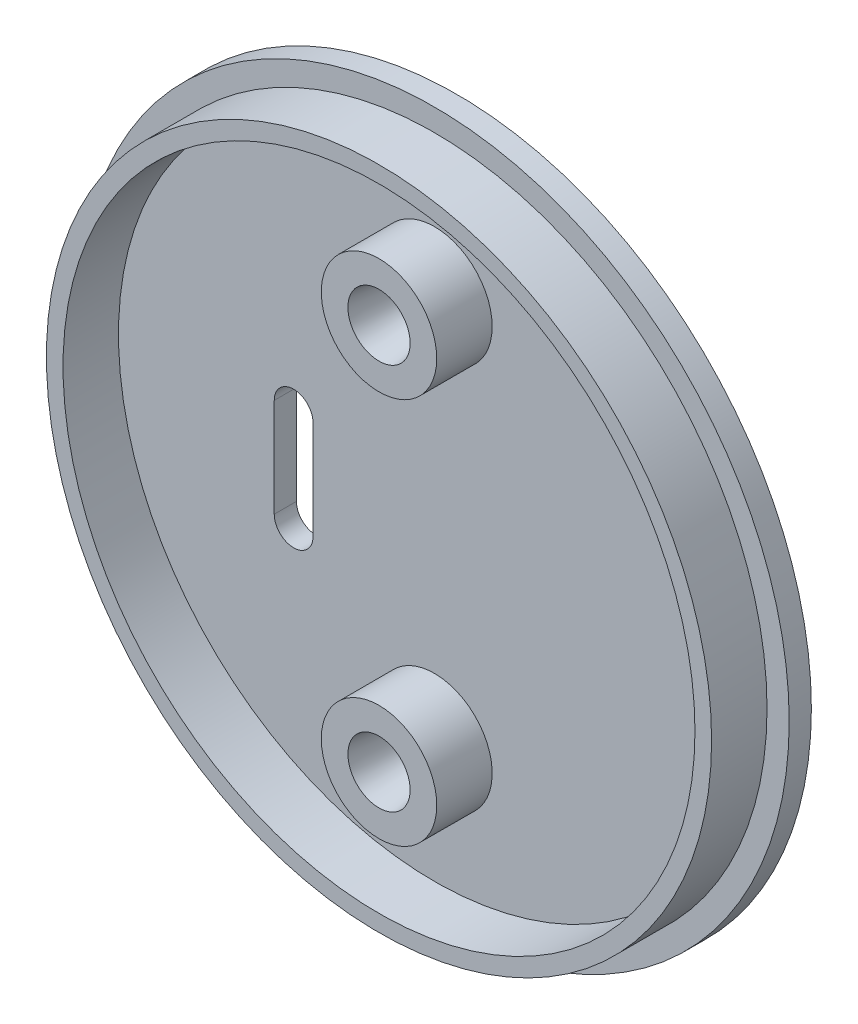
ISO-10303-21;
HEADER;
FILE_DESCRIPTION(('STEP AP214'),'2;1');
FILE_NAME('part.step','',(''),(''),'','','');
FILE_SCHEMA(('AUTOMOTIVE_DESIGN { 1 0 10303 214 1 1 1 1 }'));
ENDSEC;
DATA;
#1=APPLICATION_CONTEXT('core data for automotive mechanical design processes');
#2=APPLICATION_PROTOCOL_DEFINITION('international standard','automotive_design',2000,#1);
#3=PRODUCT_CONTEXT('',#1,'mechanical');
#4=PRODUCT('Part','Part','',(#3));
#5=PRODUCT_RELATED_PRODUCT_CATEGORY('part','',(#4));
#6=PRODUCT_DEFINITION_FORMATION('','',#4);
#7=PRODUCT_DEFINITION_CONTEXT('part definition',#1,'design');
#8=PRODUCT_DEFINITION('design','',#6,#7);
#9=PRODUCT_DEFINITION_SHAPE('','',#8);
#10=(LENGTH_UNIT() NAMED_UNIT(*) SI_UNIT(.MILLI.,.METRE.));
#11=(NAMED_UNIT(*) PLANE_ANGLE_UNIT() SI_UNIT($,.RADIAN.));
#12=(NAMED_UNIT(*) SI_UNIT($,.STERADIAN.) SOLID_ANGLE_UNIT());
#13=UNCERTAINTY_MEASURE_WITH_UNIT(LENGTH_MEASURE(1.E-05),#10,'distance_accuracy_value','');
#14=(GEOMETRIC_REPRESENTATION_CONTEXT(3) GLOBAL_UNCERTAINTY_ASSIGNED_CONTEXT((#13)) GLOBAL_UNIT_ASSIGNED_CONTEXT((#10,
#11,#12)) REPRESENTATION_CONTEXT('',''));
#15=CARTESIAN_POINT('',(0.,0.,0.));
#16=DIRECTION('',(0.,0.,1.));
#17=DIRECTION('',(1.,0.,0.));
#18=AXIS2_PLACEMENT_3D('',#15,#16,#17);
#19=CARTESIAN_POINT('',(0.,0.,0.999998));
#20=DIRECTION('',(0.,0.,-1.));
#21=DIRECTION('',(-1.,0.,0.));
#22=AXIS2_PLACEMENT_3D('',#19,#20,#21);
#23=CYLINDRICAL_SURFACE('',#22,32.);
#24=CARTESIAN_POINT('',(0.,0.,0.999998));
#25=DIRECTION('',(0.,0.,1.));
#26=DIRECTION('',(1.,0.,0.));
#27=AXIS2_PLACEMENT_3D('',#24,#25,#26);
#28=CIRCLE('',#27,32.);
#29=CARTESIAN_POINT('',(32.,0.,0.999998));
#30=VERTEX_POINT('',#29);
#31=EDGE_CURVE('E133',#30,#30,#28,.T.);
#32=ORIENTED_EDGE('',*,*,#31,.F.);
#33=EDGE_LOOP('',(#32));
#34=FACE_BOUND('',#33,.T.);
#35=CARTESIAN_POINT('',(0.,0.,-0.999998));
#36=DIRECTION('',(0.,0.,1.));
#37=DIRECTION('',(1.,0.,0.));
#38=AXIS2_PLACEMENT_3D('',#35,#36,#37);
#39=CIRCLE('',#38,32.);
#40=CARTESIAN_POINT('',(32.,0.,-0.999998));
#41=VERTEX_POINT('',#40);
#42=EDGE_CURVE('E130',#41,#41,#39,.T.);
#43=ORIENTED_EDGE('',*,*,#42,.T.);
#44=EDGE_LOOP('',(#43));
#45=FACE_BOUND('',#44,.T.);
#46=ADVANCED_FACE('F36',(#34,#45),#23,.T.);
#47=CARTESIAN_POINT('',(0.,0.,0.999998));
#48=DIRECTION('',(0.,0.,1.));
#49=DIRECTION('',(1.,0.,0.));
#50=AXIS2_PLACEMENT_3D('',#47,#48,#49);
#51=PLANE('',#50);
#52=CARTESIAN_POINT('',(0.,0.,0.999998));
#53=DIRECTION('',(0.,0.,1.));
#54=DIRECTION('',(1.,0.,0.));
#55=AXIS2_PLACEMENT_3D('',#52,#53,#54);
#56=CIRCLE('',#55,30.);
#57=CARTESIAN_POINT('',(30.,0.,0.999998));
#58=VERTEX_POINT('',#57);
#59=EDGE_CURVE('E126',#58,#58,#56,.T.);
#60=ORIENTED_EDGE('',*,*,#59,.F.);
#61=EDGE_LOOP('',(#60));
#62=FACE_BOUND('',#61,.T.);
#63=ORIENTED_EDGE('',*,*,#31,.T.);
#64=EDGE_LOOP('',(#63));
#65=FACE_BOUND('',#64,.T.);
#66=ADVANCED_FACE('F146',(#62,#65),#51,.T.);
#67=CARTESIAN_POINT('',(0.,0.,-0.999998));
#68=DIRECTION('',(0.,0.,1.));
#69=DIRECTION('',(1.,0.,0.));
#70=AXIS2_PLACEMENT_3D('',#67,#68,#69);
#71=PLANE('',#70);
#72=DIRECTION('',(0.,1.,0.));
#73=VECTOR('',#72,1.);
#74=CARTESIAN_POINT('',(-10.95,1.85420000000004,-0.999998));
#75=LINE('',#74,#73);
#76=CARTESIAN_POINT('',(-10.95,1.85420000000004,-0.999998));
#77=VERTEX_POINT('',#76);
#78=CARTESIAN_POINT('',(-10.95,-7.03579999999996,-0.999998));
#79=VERTEX_POINT('',#78);
#80=EDGE_CURVE('E102',#77,#79,#75,.F.);
#81=ORIENTED_EDGE('',*,*,#80,.F.);
#82=CARTESIAN_POINT('',(-12.7,1.85420000000004,-0.999998));
#83=DIRECTION('',(0.,0.,-1.));
#84=DIRECTION('',(-1.,0.,0.));
#85=AXIS2_PLACEMENT_3D('',#82,#83,#84);
#86=CIRCLE('',#85,1.75);
#87=CARTESIAN_POINT('',(-14.45,1.85420000000004,-0.999998));
#88=VERTEX_POINT('',#87);
#89=EDGE_CURVE('E39',#88,#77,#86,.T.);
#90=ORIENTED_EDGE('',*,*,#89,.F.);
#91=DIRECTION('',(0.,1.,0.));
#92=VECTOR('',#91,1.);
#93=CARTESIAN_POINT('',(-14.45,1.85420000000004,-0.999998));
#94=LINE('',#93,#92);
#95=CARTESIAN_POINT('',(-14.45,-7.03579999999996,-0.999998));
#96=VERTEX_POINT('',#95);
#97=EDGE_CURVE('E105',#96,#88,#94,.T.);
#98=ORIENTED_EDGE('',*,*,#97,.F.);
#99=CARTESIAN_POINT('',(-12.7,-7.03579999999996,-0.999998));
#100=DIRECTION('',(0.,0.,-1.));
#101=DIRECTION('',(-1.,0.,0.));
#102=AXIS2_PLACEMENT_3D('',#99,#100,#101);
#103=CIRCLE('',#102,1.75);
#104=EDGE_CURVE('E74',#79,#96,#103,.T.);
#105=ORIENTED_EDGE('',*,*,#104,.F.);
#106=EDGE_LOOP('',(#81,#90,#98,#105));
#107=FACE_BOUND('',#106,.T.);
#108=ORIENTED_EDGE('',*,*,#42,.F.);
#109=EDGE_LOOP('',(#108));
#110=FACE_BOUND('',#109,.T.);
#111=ADVANCED_FACE('F159',(#107,#110),#71,.F.);
#112=CARTESIAN_POINT('',(0.,0.,5.999998));
#113=DIRECTION('',(0.,0.,1.));
#114=DIRECTION('',(1.,0.,0.));
#115=AXIS2_PLACEMENT_3D('',#112,#113,#114);
#116=PLANE('',#115);
#117=CARTESIAN_POINT('',(0.,0.,5.999998));
#118=DIRECTION('',(0.,0.,1.));
#119=DIRECTION('',(1.,0.,0.));
#120=AXIS2_PLACEMENT_3D('',#117,#118,#119);
#121=CIRCLE('',#120,30.);
#122=CARTESIAN_POINT('',(30.,0.,5.999998));
#123=VERTEX_POINT('',#122);
#124=EDGE_CURVE('E127',#123,#123,#121,.T.);
#125=ORIENTED_EDGE('',*,*,#124,.T.);
#126=EDGE_LOOP('',(#125));
#127=FACE_BOUND('',#126,.T.);
#128=CARTESIAN_POINT('',(0.,0.,5.999998));
#129=DIRECTION('',(0.,0.,1.));
#130=DIRECTION('',(1.,0.,0.));
#131=AXIS2_PLACEMENT_3D('',#128,#129,#130);
#132=CIRCLE('',#131,28.5);
#133=CARTESIAN_POINT('',(28.5,0.,5.999998));
#134=VERTEX_POINT('',#133);
#135=EDGE_CURVE('E123',#134,#134,#132,.T.);
#136=ORIENTED_EDGE('',*,*,#135,.F.);
#137=EDGE_LOOP('',(#136));
#138=FACE_BOUND('',#137,.T.);
#139=ADVANCED_FACE('F170',(#127,#138),#116,.T.);
#140=CARTESIAN_POINT('',(0.,0.,5.999998));
#141=DIRECTION('',(0.,0.,-1.));
#142=DIRECTION('',(-1.,0.,0.));
#143=AXIS2_PLACEMENT_3D('',#140,#141,#142);
#144=CYLINDRICAL_SURFACE('',#143,30.);
#145=ORIENTED_EDGE('',*,*,#124,.F.);
#146=EDGE_LOOP('',(#145));
#147=FACE_BOUND('',#146,.T.);
#148=ORIENTED_EDGE('',*,*,#59,.T.);
#149=EDGE_LOOP('',(#148));
#150=FACE_BOUND('',#149,.T.);
#151=ADVANCED_FACE('F154',(#147,#150),#144,.T.);
#152=CARTESIAN_POINT('',(0.,0.,5.999998));
#153=DIRECTION('',(0.,0.,-1.));
#154=DIRECTION('',(-1.,0.,0.));
#155=AXIS2_PLACEMENT_3D('',#152,#153,#154);
#156=CYLINDRICAL_SURFACE('',#155,28.5);
#157=ORIENTED_EDGE('',*,*,#135,.T.);
#158=EDGE_LOOP('',(#157));
#159=FACE_BOUND('',#158,.T.);
#160=CARTESIAN_POINT('',(0.,0.,0.999998));
#161=DIRECTION('',(0.,0.,1.));
#162=DIRECTION('',(1.,0.,0.));
#163=AXIS2_PLACEMENT_3D('',#160,#161,#162);
#164=CIRCLE('',#163,28.5);
#165=CARTESIAN_POINT('',(28.5,0.,0.999998));
#166=VERTEX_POINT('',#165);
#167=EDGE_CURVE('E88',#166,#166,#164,.F.);
#168=ORIENTED_EDGE('',*,*,#167,.T.);
#169=EDGE_LOOP('',(#168));
#170=FACE_BOUND('',#169,.T.);
#171=ADVANCED_FACE('F141',(#159,#170),#156,.F.);
#172=CARTESIAN_POINT('',(-12.7,1.85420000000004,0.999998));
#173=DIRECTION('',(0.,0.,1.));
#174=DIRECTION('',(1.,0.,0.));
#175=AXIS2_PLACEMENT_3D('',#172,#173,#174);
#176=CIRCLE('',#175,1.75);
#177=CARTESIAN_POINT('',(-10.95,1.85420000000004,0.999998));
#178=VERTEX_POINT('',#177);
#179=CARTESIAN_POINT('',(-14.45,1.85420000000004,0.999998));
#180=VERTEX_POINT('',#179);
#181=EDGE_CURVE('E11',#178,#180,#176,.T.);
#182=ORIENTED_EDGE('',*,*,#181,.F.);
#183=DIRECTION('',(0.,1.,0.));
#184=VECTOR('',#183,1.);
#185=CARTESIAN_POINT('',(-10.95,0.,0.999998));
#186=LINE('',#185,#184);
#187=CARTESIAN_POINT('',(-10.95,-7.03579999999996,0.999998));
#188=VERTEX_POINT('',#187);
#189=EDGE_CURVE('E82',#188,#178,#186,.T.);
#190=ORIENTED_EDGE('',*,*,#189,.F.);
#191=CARTESIAN_POINT('',(-12.7,-7.03579999999996,0.999998));
#192=DIRECTION('',(0.,0.,1.));
#193=DIRECTION('',(1.,0.,0.));
#194=AXIS2_PLACEMENT_3D('',#191,#192,#193);
#195=CIRCLE('',#194,1.75);
#196=CARTESIAN_POINT('',(-14.45,-7.03579999999996,0.999998));
#197=VERTEX_POINT('',#196);
#198=EDGE_CURVE('E87',#197,#188,#195,.T.);
#199=ORIENTED_EDGE('',*,*,#198,.F.);
#200=DIRECTION('',(0.,-1.,0.));
#201=VECTOR('',#200,1.);
#202=CARTESIAN_POINT('',(-14.45,0.,0.999998));
#203=LINE('',#202,#201);
#204=EDGE_CURVE('E44',#180,#197,#203,.T.);
#205=ORIENTED_EDGE('',*,*,#204,.F.);
#206=EDGE_LOOP('',(#182,#190,#199,#205));
#207=FACE_BOUND('',#206,.T.);
#208=CARTESIAN_POINT('',(0.,-17.4498,0.999998));
#209=DIRECTION('',(0.,0.,1.));
#210=DIRECTION('',(-1.,0.,0.));
#211=AXIS2_PLACEMENT_3D('',#208,#209,#210);
#212=CIRCLE('',#211,5.207);
#213=CARTESIAN_POINT('',(-5.207,-17.4498,0.999998));
#214=VERTEX_POINT('',#213);
#215=EDGE_CURVE('E107',#214,#214,#212,.T.);
#216=ORIENTED_EDGE('',*,*,#215,.F.);
#217=EDGE_LOOP('',(#216));
#218=FACE_BOUND('',#217,.T.);
#219=CARTESIAN_POINT('',(0.,17.4498,0.999998));
#220=DIRECTION('',(0.,0.,1.));
#221=DIRECTION('',(1.,0.,0.));
#222=AXIS2_PLACEMENT_3D('',#219,#220,#221);
#223=CIRCLE('',#222,5.207);
#224=CARTESIAN_POINT('',(5.20700000000001,17.4498,0.999998));
#225=VERTEX_POINT('',#224);
#226=EDGE_CURVE('E114',#225,#225,#223,.T.);
#227=ORIENTED_EDGE('',*,*,#226,.F.);
#228=EDGE_LOOP('',(#227));
#229=FACE_BOUND('',#228,.T.);
#230=ORIENTED_EDGE('',*,*,#167,.F.);
#231=EDGE_LOOP('',(#230));
#232=FACE_BOUND('',#231,.T.);
#233=ADVANCED_FACE('F97',(#207,#218,#229,#232),#51,.T.);
#234=CARTESIAN_POINT('',(0.,17.4498,20.7276180385534));
#235=DIRECTION('',(0.,0.,-1.));
#236=DIRECTION('',(-1.,0.,0.));
#237=AXIS2_PLACEMENT_3D('',#234,#235,#236);
#238=CYLINDRICAL_SURFACE('',#237,5.207);
#239=ORIENTED_EDGE('',*,*,#226,.T.);
#240=EDGE_LOOP('',(#239));
#241=FACE_BOUND('',#240,.T.);
#242=CARTESIAN_POINT('',(0.,17.4498,5.999998));
#243=DIRECTION('',(0.,0.,1.));
#244=DIRECTION('',(1.,0.,0.));
#245=AXIS2_PLACEMENT_3D('',#242,#243,#244);
#246=CIRCLE('',#245,5.207);
#247=CARTESIAN_POINT('',(5.20700000000001,17.4498,5.999998));
#248=VERTEX_POINT('',#247);
#249=EDGE_CURVE('E120',#248,#248,#246,.T.);
#250=ORIENTED_EDGE('',*,*,#249,.F.);
#251=EDGE_LOOP('',(#250));
#252=FACE_BOUND('',#251,.T.);
#253=ADVANCED_FACE('F144',(#241,#252),#238,.T.);
#254=CARTESIAN_POINT('',(0.,0.,5.999998));
#255=DIRECTION('',(0.,0.,1.));
#256=DIRECTION('',(1.,0.,0.));
#257=AXIS2_PLACEMENT_3D('',#254,#255,#256);
#258=PLANE('',#257);
#259=CARTESIAN_POINT('',(0.,17.4498,5.999998));
#260=DIRECTION('',(0.,0.,1.));
#261=DIRECTION('',(1.,0.,0.));
#262=AXIS2_PLACEMENT_3D('',#259,#260,#261);
#263=CIRCLE('',#262,2.8067);
#264=CARTESIAN_POINT('',(2.8067,17.4498,5.999998));
#265=VERTEX_POINT('',#264);
#266=EDGE_CURVE('E185',#265,#265,#263,.T.);
#267=ORIENTED_EDGE('',*,*,#266,.F.);
#268=EDGE_LOOP('',(#267));
#269=FACE_BOUND('',#268,.T.);
#270=ORIENTED_EDGE('',*,*,#249,.T.);
#271=EDGE_LOOP('',(#270));
#272=FACE_BOUND('',#271,.T.);
#273=ADVANCED_FACE('F151',(#269,#272),#258,.T.);
#274=CARTESIAN_POINT('',(0.,-17.4498,20.7276180385534));
#275=DIRECTION('',(0.,0.,-1.));
#276=DIRECTION('',(-1.,0.,0.));
#277=AXIS2_PLACEMENT_3D('',#274,#275,#276);
#278=CYLINDRICAL_SURFACE('',#277,5.207);
#279=ORIENTED_EDGE('',*,*,#215,.T.);
#280=EDGE_LOOP('',(#279));
#281=FACE_BOUND('',#280,.T.);
#282=CARTESIAN_POINT('',(0.,-17.4498,5.999998));
#283=DIRECTION('',(0.,0.,1.));
#284=DIRECTION('',(1.,0.,0.));
#285=AXIS2_PLACEMENT_3D('',#282,#283,#284);
#286=CIRCLE('',#285,5.207);
#287=CARTESIAN_POINT('',(5.20700000000001,-17.4498,5.999998));
#288=VERTEX_POINT('',#287);
#289=EDGE_CURVE('E109',#288,#288,#286,.T.);
#290=ORIENTED_EDGE('',*,*,#289,.F.);
#291=EDGE_LOOP('',(#290));
#292=FACE_BOUND('',#291,.T.);
#293=ADVANCED_FACE('F198',(#281,#292),#278,.T.);
#294=CARTESIAN_POINT('',(0.,0.,5.999998));
#295=DIRECTION('',(0.,0.,1.));
#296=DIRECTION('',(1.,0.,0.));
#297=AXIS2_PLACEMENT_3D('',#294,#295,#296);
#298=PLANE('',#297);
#299=CARTESIAN_POINT('',(0.,-17.4498,5.999998));
#300=DIRECTION('',(0.,0.,1.));
#301=DIRECTION('',(1.,0.,0.));
#302=AXIS2_PLACEMENT_3D('',#299,#300,#301);
#303=CIRCLE('',#302,2.8067);
#304=CARTESIAN_POINT('',(2.8067,-17.4498,5.999998));
#305=VERTEX_POINT('',#304);
#306=EDGE_CURVE('E186',#305,#305,#303,.T.);
#307=ORIENTED_EDGE('',*,*,#306,.F.);
#308=EDGE_LOOP('',(#307));
#309=FACE_BOUND('',#308,.T.);
#310=ORIENTED_EDGE('',*,*,#289,.T.);
#311=EDGE_LOOP('',(#310));
#312=FACE_BOUND('',#311,.T.);
#313=ADVANCED_FACE('F205',(#309,#312),#298,.T.);
#314=CARTESIAN_POINT('',(-12.7,1.85420000000004,5.999998));
#315=DIRECTION('',(0.,0.,-1.));
#316=DIRECTION('',(-1.,0.,0.));
#317=AXIS2_PLACEMENT_3D('',#314,#315,#316);
#318=CYLINDRICAL_SURFACE('',#317,1.75);
#319=DIRECTION('',(0.,0.,-1.));
#320=VECTOR('',#319,1.);
#321=CARTESIAN_POINT('',(-10.95,1.85420000000004,5.999998));
#322=LINE('',#321,#320);
#323=EDGE_CURVE('E52',#178,#77,#322,.T.);
#324=ORIENTED_EDGE('',*,*,#323,.F.);
#325=ORIENTED_EDGE('',*,*,#181,.T.);
#326=DIRECTION('',(0.,0.,-1.));
#327=VECTOR('',#326,1.);
#328=CARTESIAN_POINT('',(-14.45,1.85420000000004,5.999998));
#329=LINE('',#328,#327);
#330=EDGE_CURVE('E104',#180,#88,#329,.T.);
#331=ORIENTED_EDGE('',*,*,#330,.T.);
#332=ORIENTED_EDGE('',*,*,#89,.T.);
#333=EDGE_LOOP('',(#324,#325,#331,#332));
#334=FACE_BOUND('',#333,.T.);
#335=ADVANCED_FACE('F91',(#334),#318,.F.);
#336=CARTESIAN_POINT('',(-14.45,1.85420000000004,5.999998));
#337=DIRECTION('',(-1.,0.,0.));
#338=DIRECTION('',(0.,0.,1.));
#339=AXIS2_PLACEMENT_3D('',#336,#337,#338);
#340=PLANE('',#339);
#341=ORIENTED_EDGE('',*,*,#330,.F.);
#342=ORIENTED_EDGE('',*,*,#204,.T.);
#343=DIRECTION('',(0.,0.,-1.));
#344=VECTOR('',#343,1.);
#345=CARTESIAN_POINT('',(-14.45,-7.03579999999996,5.999998));
#346=LINE('',#345,#344);
#347=EDGE_CURVE('E178',#197,#96,#346,.T.);
#348=ORIENTED_EDGE('',*,*,#347,.T.);
#349=ORIENTED_EDGE('',*,*,#97,.T.);
#350=EDGE_LOOP('',(#341,#342,#348,#349));
#351=FACE_BOUND('',#350,.T.);
#352=ADVANCED_FACE('F258',(#351),#340,.F.);
#353=CARTESIAN_POINT('',(-12.7,-7.03579999999996,5.999998));
#354=DIRECTION('',(0.,0.,-1.));
#355=DIRECTION('',(-1.,0.,0.));
#356=AXIS2_PLACEMENT_3D('',#353,#354,#355);
#357=CYLINDRICAL_SURFACE('',#356,1.75);
#358=ORIENTED_EDGE('',*,*,#347,.F.);
#359=ORIENTED_EDGE('',*,*,#198,.T.);
#360=DIRECTION('',(0.,0.,-1.));
#361=VECTOR('',#360,1.);
#362=CARTESIAN_POINT('',(-10.95,-7.03579999999996,5.999998));
#363=LINE('',#362,#361);
#364=EDGE_CURVE('E58',#188,#79,#363,.T.);
#365=ORIENTED_EDGE('',*,*,#364,.T.);
#366=ORIENTED_EDGE('',*,*,#104,.T.);
#367=EDGE_LOOP('',(#358,#359,#365,#366));
#368=FACE_BOUND('',#367,.T.);
#369=ADVANCED_FACE('F177',(#368),#357,.F.);
#370=CARTESIAN_POINT('',(-10.95,1.85420000000004,5.999998));
#371=DIRECTION('',(1.,0.,0.));
#372=DIRECTION('',(0.,0.,-1.));
#373=AXIS2_PLACEMENT_3D('',#370,#371,#372);
#374=PLANE('',#373);
#375=ORIENTED_EDGE('',*,*,#364,.F.);
#376=ORIENTED_EDGE('',*,*,#189,.T.);
#377=ORIENTED_EDGE('',*,*,#323,.T.);
#378=ORIENTED_EDGE('',*,*,#80,.T.);
#379=EDGE_LOOP('',(#375,#376,#377,#378));
#380=FACE_BOUND('',#379,.T.);
#381=ADVANCED_FACE('F83',(#380),#374,.F.);
#382=CARTESIAN_POINT('',(0.,-17.4498,5.999998));
#383=DIRECTION('',(0.,0.,1.));
#384=DIRECTION('',(1.,0.,0.));
#385=AXIS2_PLACEMENT_3D('',#382,#383,#384);
#386=CONICAL_SURFACE('',#385,2.8067,0.139626340159547);
#387=CARTESIAN_POINT('',(0.,-17.4498,1.299998));
#388=DIRECTION('',(0.,0.,1.));
#389=DIRECTION('',(1.,0.,0.));
#390=AXIS2_PLACEMENT_3D('',#387,#388,#389);
#391=CIRCLE('',#390,2.14615807689876);
#392=CARTESIAN_POINT('',(2.14615807689876,-17.4498,1.299998));
#393=VERTEX_POINT('',#392);
#394=EDGE_CURVE('E182',#393,#393,#391,.T.);
#395=ORIENTED_EDGE('',*,*,#394,.F.);
#396=EDGE_LOOP('',(#395));
#397=FACE_BOUND('',#396,.T.);
#398=ORIENTED_EDGE('',*,*,#306,.T.);
#399=EDGE_LOOP('',(#398));
#400=FACE_BOUND('',#399,.T.);
#401=ADVANCED_FACE('F282',(#397,#400),#386,.F.);
#402=CARTESIAN_POINT('',(0.,-17.4498,1.299998));
#403=DIRECTION('',(0.,0.,1.));
#404=DIRECTION('',(1.,0.,0.));
#405=AXIS2_PLACEMENT_3D('',#402,#403,#404);
#406=PLANE('',#405);
#407=ORIENTED_EDGE('',*,*,#394,.T.);
#408=EDGE_LOOP('',(#407));
#409=FACE_BOUND('',#408,.T.);
#410=ADVANCED_FACE('F301',(#409),#406,.T.);
#411=CARTESIAN_POINT('',(0.,17.4498,5.999998));
#412=DIRECTION('',(0.,0.,1.));
#413=DIRECTION('',(1.,0.,0.));
#414=AXIS2_PLACEMENT_3D('',#411,#412,#413);
#415=CONICAL_SURFACE('',#414,2.8067,0.139626340159547);
#416=CARTESIAN_POINT('',(0.,17.4498,1.299998));
#417=DIRECTION('',(0.,0.,1.));
#418=DIRECTION('',(1.,0.,0.));
#419=AXIS2_PLACEMENT_3D('',#416,#417,#418);
#420=CIRCLE('',#419,2.14615807689876);
#421=CARTESIAN_POINT('',(2.14615807689876,17.4498,1.299998));
#422=VERTEX_POINT('',#421);
#423=EDGE_CURVE('E95',#422,#422,#420,.T.);
#424=ORIENTED_EDGE('',*,*,#423,.F.);
#425=EDGE_LOOP('',(#424));
#426=FACE_BOUND('',#425,.T.);
#427=ORIENTED_EDGE('',*,*,#266,.T.);
#428=EDGE_LOOP('',(#427));
#429=FACE_BOUND('',#428,.T.);
#430=ADVANCED_FACE('F194',(#426,#429),#415,.F.);
#431=CARTESIAN_POINT('',(0.,17.4498,1.299998));
#432=DIRECTION('',(0.,0.,1.));
#433=DIRECTION('',(1.,0.,0.));
#434=AXIS2_PLACEMENT_3D('',#431,#432,#433);
#435=PLANE('',#434);
#436=ORIENTED_EDGE('',*,*,#423,.T.);
#437=EDGE_LOOP('',(#436));
#438=FACE_BOUND('',#437,.T.);
#439=ADVANCED_FACE('F320',(#438),#435,.T.);
#440=CLOSED_SHELL('',(#46,#66,#111,#139,#151,#171,#233,#253,#273,#293,#313,#335,#352,#369,#381,
#401,#410,#430,#439));
#441=MANIFOLD_SOLID_BREP('B2',#440);
#442=ADVANCED_BREP_SHAPE_REPRESENTATION('',(#18,#441),#14);
#443=SHAPE_DEFINITION_REPRESENTATION(#9,#442);
ENDSEC;
END-ISO-10303-21;
